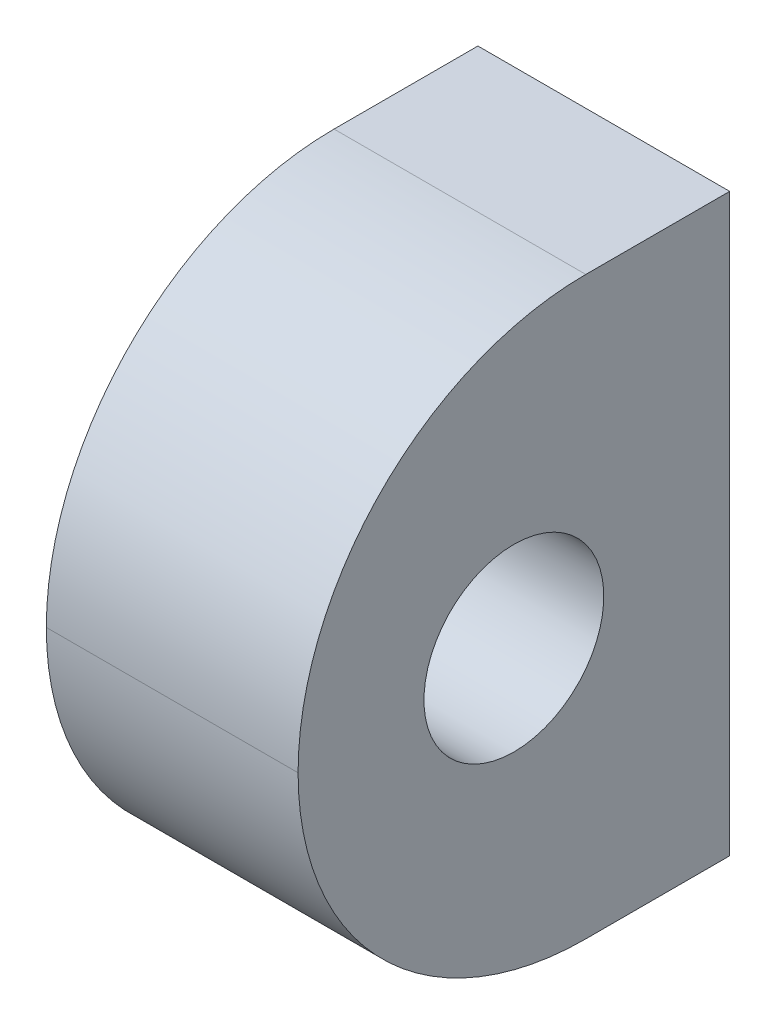
ISO-10303-21;
HEADER;
FILE_DESCRIPTION(('STEP AP214'),'2;1');
FILE_NAME('part.step','',(''),(''),'','','');
FILE_SCHEMA(('AUTOMOTIVE_DESIGN { 1 0 10303 214 1 1 1 1 }'));
ENDSEC;
DATA;
#1=APPLICATION_CONTEXT('core data for automotive mechanical design processes');
#2=APPLICATION_PROTOCOL_DEFINITION('international standard','automotive_design',2000,#1);
#3=PRODUCT_CONTEXT('',#1,'mechanical');
#4=PRODUCT('Part','Part','',(#3));
#5=PRODUCT_RELATED_PRODUCT_CATEGORY('part','',(#4));
#6=PRODUCT_DEFINITION_FORMATION('','',#4);
#7=PRODUCT_DEFINITION_CONTEXT('part definition',#1,'design');
#8=PRODUCT_DEFINITION('design','',#6,#7);
#9=PRODUCT_DEFINITION_SHAPE('','',#8);
#10=(LENGTH_UNIT() NAMED_UNIT(*) SI_UNIT(.MILLI.,.METRE.));
#11=(NAMED_UNIT(*) PLANE_ANGLE_UNIT() SI_UNIT($,.RADIAN.));
#12=(NAMED_UNIT(*) SI_UNIT($,.STERADIAN.) SOLID_ANGLE_UNIT());
#13=UNCERTAINTY_MEASURE_WITH_UNIT(LENGTH_MEASURE(1.E-05),#10,'distance_accuracy_value','');
#14=(GEOMETRIC_REPRESENTATION_CONTEXT(3) GLOBAL_UNCERTAINTY_ASSIGNED_CONTEXT((#13)) GLOBAL_UNIT_ASSIGNED_CONTEXT((#10,
#11,#12)) REPRESENTATION_CONTEXT('',''));
#15=CARTESIAN_POINT('',(0.,0.,0.));
#16=DIRECTION('',(0.,0.,1.));
#17=DIRECTION('',(1.,0.,0.));
#18=AXIS2_PLACEMENT_3D('',#15,#16,#17);
#19=CARTESIAN_POINT('',(0.,0.,38.1));
#20=DIRECTION('',(1.,0.,0.));
#21=DIRECTION('',(0.,1.,0.));
#22=AXIS2_PLACEMENT_3D('',#19,#20,#21);
#23=PLANE('',#22);
#24=CARTESIAN_POINT('',(0.,25.4,19.05));
#25=DIRECTION('',(1.,0.,0.));
#26=DIRECTION('',(0.,1.,0.));
#27=AXIS2_PLACEMENT_3D('',#24,#25,#26);
#28=CIRCLE('',#27,7.9375);
#29=CARTESIAN_POINT('',(0.,33.3375,19.05));
#30=VERTEX_POINT('',#29);
#31=EDGE_CURVE('E112',#30,#30,#28,.T.);
#32=ORIENTED_EDGE('',*,*,#31,.T.);
#33=EDGE_LOOP('',(#32));
#34=FACE_BOUND('',#33,.T.);
#35=DIRECTION('',(0.,0.,-1.));
#36=VECTOR('',#35,1.);
#37=CARTESIAN_POINT('',(0.,0.,38.1));
#38=LINE('',#37,#36);
#39=CARTESIAN_POINT('',(0.,0.,12.7));
#40=VERTEX_POINT('',#39);
#41=CARTESIAN_POINT('',(0.,0.,0.));
#42=VERTEX_POINT('',#41);
#43=EDGE_CURVE('E84',#40,#42,#38,.T.);
#44=ORIENTED_EDGE('',*,*,#43,.F.);
#45=CARTESIAN_POINT('',(0.,25.4,12.7));
#46=DIRECTION('',(1.,0.,0.));
#47=DIRECTION('',(0.,1.,0.));
#48=AXIS2_PLACEMENT_3D('',#45,#46,#47);
#49=CIRCLE('',#48,25.4);
#50=CARTESIAN_POINT('',(0.,25.4,38.1));
#51=VERTEX_POINT('',#50);
#52=EDGE_CURVE('E49',#40,#51,#49,.F.);
#53=ORIENTED_EDGE('',*,*,#52,.T.);
#54=CARTESIAN_POINT('',(0.,25.4,12.7));
#55=DIRECTION('',(1.,0.,0.));
#56=DIRECTION('',(0.,1.,0.));
#57=AXIS2_PLACEMENT_3D('',#54,#55,#56);
#58=CIRCLE('',#57,25.4);
#59=CARTESIAN_POINT('',(0.,50.8,12.7));
#60=VERTEX_POINT('',#59);
#61=EDGE_CURVE('E56',#51,#60,#58,.F.);
#62=ORIENTED_EDGE('',*,*,#61,.T.);
#63=DIRECTION('',(0.,0.,-1.));
#64=VECTOR('',#63,1.);
#65=CARTESIAN_POINT('',(0.,50.8,38.1));
#66=LINE('',#65,#64);
#67=CARTESIAN_POINT('',(0.,50.8,0.));
#68=VERTEX_POINT('',#67);
#69=EDGE_CURVE('E106',#60,#68,#66,.T.);
#70=ORIENTED_EDGE('',*,*,#69,.T.);
#71=DIRECTION('',(0.,-1.,0.));
#72=VECTOR('',#71,1.);
#73=CARTESIAN_POINT('',(0.,0.,0.));
#74=LINE('',#73,#72);
#75=EDGE_CURVE('E101',#68,#42,#74,.T.);
#76=ORIENTED_EDGE('',*,*,#75,.T.);
#77=EDGE_LOOP('',(#44,#53,#62,#70,#76));
#78=FACE_BOUND('',#77,.T.);
#79=ADVANCED_FACE('F39',(#34,#78),#23,.F.);
#80=CARTESIAN_POINT('',(0.,0.,38.1));
#81=DIRECTION('',(0.,1.,0.));
#82=DIRECTION('',(0.,0.,1.));
#83=AXIS2_PLACEMENT_3D('',#80,#81,#82);
#84=PLANE('',#83);
#85=DIRECTION('',(0.,0.,-1.));
#86=VECTOR('',#85,1.);
#87=CARTESIAN_POINT('',(22.225,0.,38.1));
#88=LINE('',#87,#86);
#89=CARTESIAN_POINT('',(22.225,0.,12.7));
#90=VERTEX_POINT('',#89);
#91=CARTESIAN_POINT('',(22.225,0.,0.));
#92=VERTEX_POINT('',#91);
#93=EDGE_CURVE('E95',#90,#92,#88,.T.);
#94=ORIENTED_EDGE('',*,*,#93,.F.);
#95=DIRECTION('',(1.,0.,0.));
#96=VECTOR('',#95,1.);
#97=CARTESIAN_POINT('',(0.,0.,12.7));
#98=LINE('',#97,#96);
#99=EDGE_CURVE('E91',#90,#40,#98,.F.);
#100=ORIENTED_EDGE('',*,*,#99,.T.);
#101=ORIENTED_EDGE('',*,*,#43,.T.);
#102=DIRECTION('',(1.,0.,0.));
#103=VECTOR('',#102,1.);
#104=CARTESIAN_POINT('',(0.,0.,0.));
#105=LINE('',#104,#103);
#106=EDGE_CURVE('E88',#42,#92,#105,.T.);
#107=ORIENTED_EDGE('',*,*,#106,.T.);
#108=EDGE_LOOP('',(#94,#100,#101,#107));
#109=FACE_BOUND('',#108,.T.);
#110=ADVANCED_FACE('F87',(#109),#84,.F.);
#111=CARTESIAN_POINT('',(22.225,0.,38.1));
#112=DIRECTION('',(-1.,0.,0.));
#113=DIRECTION('',(0.,-1.,0.));
#114=AXIS2_PLACEMENT_3D('',#111,#112,#113);
#115=PLANE('',#114);
#116=CARTESIAN_POINT('',(22.225,25.4,19.05));
#117=DIRECTION('',(1.,0.,0.));
#118=DIRECTION('',(0.,1.,0.));
#119=AXIS2_PLACEMENT_3D('',#116,#117,#118);
#120=CIRCLE('',#119,7.9375);
#121=CARTESIAN_POINT('',(22.225,33.3375,19.05));
#122=VERTEX_POINT('',#121);
#123=EDGE_CURVE('E220',#122,#122,#120,.T.);
#124=ORIENTED_EDGE('',*,*,#123,.F.);
#125=EDGE_LOOP('',(#124));
#126=FACE_BOUND('',#125,.T.);
#127=CARTESIAN_POINT('',(22.225,25.4,12.7));
#128=DIRECTION('',(-1.,0.,0.));
#129=DIRECTION('',(0.,-1.,0.));
#130=AXIS2_PLACEMENT_3D('',#127,#128,#129);
#131=CIRCLE('',#130,25.4);
#132=CARTESIAN_POINT('',(22.225,50.8,12.7));
#133=VERTEX_POINT('',#132);
#134=CARTESIAN_POINT('',(22.225,25.4,38.1));
#135=VERTEX_POINT('',#134);
#136=EDGE_CURVE('E94',#133,#135,#131,.F.);
#137=ORIENTED_EDGE('',*,*,#136,.T.);
#138=CARTESIAN_POINT('',(22.225,25.4,12.7));
#139=DIRECTION('',(-1.,0.,0.));
#140=DIRECTION('',(0.,-1.,0.));
#141=AXIS2_PLACEMENT_3D('',#138,#139,#140);
#142=CIRCLE('',#141,25.4);
#143=EDGE_CURVE('E130',#135,#90,#142,.F.);
#144=ORIENTED_EDGE('',*,*,#143,.T.);
#145=ORIENTED_EDGE('',*,*,#93,.T.);
#146=DIRECTION('',(0.,1.,0.));
#147=VECTOR('',#146,1.);
#148=CARTESIAN_POINT('',(22.225,0.,0.));
#149=LINE('',#148,#147);
#150=CARTESIAN_POINT('',(22.225,50.8,0.));
#151=VERTEX_POINT('',#150);
#152=EDGE_CURVE('E103',#92,#151,#149,.T.);
#153=ORIENTED_EDGE('',*,*,#152,.T.);
#154=DIRECTION('',(0.,0.,-1.));
#155=VECTOR('',#154,1.);
#156=CARTESIAN_POINT('',(22.225,50.8,38.1));
#157=LINE('',#156,#155);
#158=EDGE_CURVE('E123',#133,#151,#157,.T.);
#159=ORIENTED_EDGE('',*,*,#158,.F.);
#160=EDGE_LOOP('',(#137,#144,#145,#153,#159));
#161=FACE_BOUND('',#160,.T.);
#162=ADVANCED_FACE('F140',(#126,#161),#115,.F.);
#163=CARTESIAN_POINT('',(0.,50.8,38.1));
#164=DIRECTION('',(0.,-1.,0.));
#165=DIRECTION('',(0.,0.,-1.));
#166=AXIS2_PLACEMENT_3D('',#163,#164,#165);
#167=PLANE('',#166);
#168=ORIENTED_EDGE('',*,*,#69,.F.);
#169=DIRECTION('',(-1.,0.,0.));
#170=VECTOR('',#169,1.);
#171=CARTESIAN_POINT('',(0.,50.8,12.7));
#172=LINE('',#171,#170);
#173=EDGE_CURVE('E11',#60,#133,#172,.F.);
#174=ORIENTED_EDGE('',*,*,#173,.T.);
#175=ORIENTED_EDGE('',*,*,#158,.T.);
#176=DIRECTION('',(-1.,0.,0.));
#177=VECTOR('',#176,1.);
#178=CARTESIAN_POINT('',(0.,50.8,0.));
#179=LINE('',#178,#177);
#180=EDGE_CURVE('E118',#151,#68,#179,.T.);
#181=ORIENTED_EDGE('',*,*,#180,.T.);
#182=EDGE_LOOP('',(#168,#174,#175,#181));
#183=FACE_BOUND('',#182,.T.);
#184=ADVANCED_FACE('F149',(#183),#167,.F.);
#185=CARTESIAN_POINT('',(0.,0.,0.));
#186=DIRECTION('',(0.,0.,-1.));
#187=DIRECTION('',(-1.,0.,0.));
#188=AXIS2_PLACEMENT_3D('',#185,#186,#187);
#189=PLANE('',#188);
#190=ORIENTED_EDGE('',*,*,#75,.F.);
#191=ORIENTED_EDGE('',*,*,#180,.F.);
#192=ORIENTED_EDGE('',*,*,#152,.F.);
#193=ORIENTED_EDGE('',*,*,#106,.F.);
#194=EDGE_LOOP('',(#190,#191,#192,#193));
#195=FACE_BOUND('',#194,.T.);
#196=ADVANCED_FACE('F99',(#195),#189,.T.);
#197=CARTESIAN_POINT('',(0.,25.4,12.7));
#198=DIRECTION('',(-1.,0.,0.));
#199=DIRECTION('',(0.,0.,1.));
#200=AXIS2_PLACEMENT_3D('',#197,#198,#199);
#201=CYLINDRICAL_SURFACE('',#200,25.4);
#202=ORIENTED_EDGE('',*,*,#173,.F.);
#203=ORIENTED_EDGE('',*,*,#61,.F.);
#204=DIRECTION('',(-1.,0.,0.));
#205=VECTOR('',#204,1.);
#206=CARTESIAN_POINT('',(0.,25.4,38.1));
#207=LINE('',#206,#205);
#208=EDGE_CURVE('E43',#135,#51,#207,.T.);
#209=ORIENTED_EDGE('',*,*,#208,.F.);
#210=ORIENTED_EDGE('',*,*,#136,.F.);
#211=EDGE_LOOP('',(#202,#203,#209,#210));
#212=FACE_BOUND('',#211,.T.);
#213=ADVANCED_FACE('F41',(#212),#201,.T.);
#214=CARTESIAN_POINT('',(0.,25.4,12.7));
#215=DIRECTION('',(1.,0.,0.));
#216=DIRECTION('',(0.,0.,-1.));
#217=AXIS2_PLACEMENT_3D('',#214,#215,#216);
#218=CYLINDRICAL_SURFACE('',#217,25.4);
#219=ORIENTED_EDGE('',*,*,#52,.F.);
#220=ORIENTED_EDGE('',*,*,#99,.F.);
#221=ORIENTED_EDGE('',*,*,#143,.F.);
#222=ORIENTED_EDGE('',*,*,#208,.T.);
#223=EDGE_LOOP('',(#219,#220,#221,#222));
#224=FACE_BOUND('',#223,.T.);
#225=ADVANCED_FACE('F145',(#224),#218,.T.);
#226=CARTESIAN_POINT('',(-15.875,25.4,19.05));
#227=DIRECTION('',(1.,0.,0.));
#228=DIRECTION('',(0.,1.,0.));
#229=AXIS2_PLACEMENT_3D('',#226,#227,#228);
#230=CYLINDRICAL_SURFACE('',#229,7.9375);
#231=CARTESIAN_POINT('',(22.225,33.3375,19.05));
#232=CARTESIAN_POINT('',(21.9934895833333,33.3375,19.05));
#233=CARTESIAN_POINT('',(21.7619791666667,33.3375,19.05));
#234=CARTESIAN_POINT('',(21.2989583333333,33.3375,19.05));
#235=CARTESIAN_POINT('',(21.0674479166667,33.3375,19.05));
#236=CARTESIAN_POINT('',(20.6044270833333,33.3375,19.05));
#237=CARTESIAN_POINT('',(20.3729166666667,33.3375,19.05));
#238=CARTESIAN_POINT('',(19.9098958333333,33.3375,19.05));
#239=CARTESIAN_POINT('',(19.6783854166667,33.3375,19.05));
#240=CARTESIAN_POINT('',(19.2153645833333,33.3375,19.05));
#241=CARTESIAN_POINT('',(18.9838541666667,33.3375,19.05));
#242=CARTESIAN_POINT('',(18.5208333333333,33.3375,19.05));
#243=CARTESIAN_POINT('',(18.2893229166667,33.3375,19.05));
#244=CARTESIAN_POINT('',(17.8263020833333,33.3375,19.05));
#245=CARTESIAN_POINT('',(17.5947916666667,33.3375,19.05));
#246=CARTESIAN_POINT('',(17.1317708333333,33.3375,19.05));
#247=CARTESIAN_POINT('',(16.9002604166667,33.3375,19.05));
#248=CARTESIAN_POINT('',(16.4372395833333,33.3375,19.05));
#249=CARTESIAN_POINT('',(16.2057291666667,33.3375,19.05));
#250=CARTESIAN_POINT('',(15.7427083333333,33.3375,19.05));
#251=CARTESIAN_POINT('',(15.5111979166667,33.3375,19.05));
#252=CARTESIAN_POINT('',(15.0481770833333,33.3375,19.05));
#253=CARTESIAN_POINT('',(14.8166666666667,33.3375,19.05));
#254=CARTESIAN_POINT('',(14.3536458333333,33.3375,19.05));
#255=CARTESIAN_POINT('',(14.1221354166667,33.3375,19.05));
#256=CARTESIAN_POINT('',(13.6591145833333,33.3375,19.05));
#257=CARTESIAN_POINT('',(13.4276041666667,33.3375,19.05));
#258=CARTESIAN_POINT('',(12.9645833333333,33.3375,19.05));
#259=CARTESIAN_POINT('',(12.7330729166667,33.3375,19.05));
#260=CARTESIAN_POINT('',(12.2700520833333,33.3375,19.05));
#261=CARTESIAN_POINT('',(12.0385416666667,33.3375,19.05));
#262=CARTESIAN_POINT('',(11.5755208333333,33.3375,19.05));
#263=CARTESIAN_POINT('',(11.3440104166667,33.3375,19.05));
#264=CARTESIAN_POINT('',(10.8809895833333,33.3375,19.05));
#265=CARTESIAN_POINT('',(10.6494791666667,33.3375,19.05));
#266=CARTESIAN_POINT('',(10.1864583333333,33.3375,19.05));
#267=CARTESIAN_POINT('',(9.95494791666666,33.3375,19.05));
#268=CARTESIAN_POINT('',(9.49192708333333,33.3375,19.05));
#269=CARTESIAN_POINT('',(9.26041666666666,33.3375,19.05));
#270=CARTESIAN_POINT('',(8.79739583333333,33.3375,19.05));
#271=CARTESIAN_POINT('',(8.56588541666666,33.3375,19.05));
#272=CARTESIAN_POINT('',(8.10286458333333,33.3375,19.05));
#273=CARTESIAN_POINT('',(7.87135416666666,33.3375,19.05));
#274=CARTESIAN_POINT('',(7.40833333333333,33.3375,19.05));
#275=CARTESIAN_POINT('',(7.17682291666666,33.3375,19.05));
#276=CARTESIAN_POINT('',(6.71380208333333,33.3375,19.05));
#277=CARTESIAN_POINT('',(6.48229166666666,33.3375,19.05));
#278=CARTESIAN_POINT('',(6.01927083333333,33.3375,19.05));
#279=CARTESIAN_POINT('',(5.78776041666666,33.3375,19.05));
#280=CARTESIAN_POINT('',(5.32473958333333,33.3375,19.05));
#281=CARTESIAN_POINT('',(5.09322916666666,33.3375,19.05));
#282=CARTESIAN_POINT('',(4.63020833333333,33.3375,19.05));
#283=CARTESIAN_POINT('',(4.39869791666666,33.3375,19.05));
#284=CARTESIAN_POINT('',(3.93567708333333,33.3375,19.05));
#285=CARTESIAN_POINT('',(3.70416666666666,33.3375,19.05));
#286=CARTESIAN_POINT('',(3.24114583333333,33.3375,19.05));
#287=CARTESIAN_POINT('',(3.00963541666666,33.3375,19.05));
#288=CARTESIAN_POINT('',(2.54661458333333,33.3375,19.05));
#289=CARTESIAN_POINT('',(2.31510416666666,33.3375,19.05));
#290=CARTESIAN_POINT('',(1.85208333333333,33.3375,19.05));
#291=CARTESIAN_POINT('',(1.62057291666666,33.3375,19.05));
#292=CARTESIAN_POINT('',(1.15755208333333,33.3375,19.05));
#293=CARTESIAN_POINT('',(0.926041666666661,33.3375,19.05));
#294=CARTESIAN_POINT('',(0.463020833333327,33.3375,19.05));
#295=CARTESIAN_POINT('',(0.23151041666666,33.3375,19.05));
#296=CARTESIAN_POINT('',(0.,33.3375,19.05));
#297=B_SPLINE_CURVE_WITH_KNOTS('',3,(#231,#232,#233,#234,#235,#236,#237,#238,#239,#240,#241,
#242,#243,#244,#245,#246,#247,#248,#249,#250,#251,#252,#253,#254,#255,#256,#257,#258,#259,#260,
#261,#262,#263,#264,#265,#266,#267,#268,#269,#270,#271,#272,#273,#274,#275,#276,#277,#278,#279,
#280,#281,#282,#283,#284,#285,#286,#287,#288,#289,#290,#291,#292,#293,#294,#295,#296),
.UNSPECIFIED.,.F.,.F.,(4,2,2,2,2,2,2,2,2,2,2,2,2,2,2,2,2,2,2,2,2,2,2,2,2,2,2,2,2,2,2,2,4),(0.,
0.694531249999998,1.3890625,2.08359375,2.778125,3.47265625,4.1671875,4.86171875,5.55625,
6.25078125,6.9453125,7.63984375,8.334375,9.02890625,9.7234375,10.41796875,11.1125,11.80703125,
12.5015625,13.19609375,13.890625,14.58515625,15.2796875,15.97421875,16.66875,17.36328125,
18.0578125,18.75234375,19.446875,20.14140625,20.8359375,21.53046875,22.225),.UNSPECIFIED.);
#298=EDGE_CURVE('BSEAM168',#122,#30,#297,.T.);
#299=ORIENTED_EDGE('',*,*,#123,.T.);
#300=ORIENTED_EDGE('',*,*,#31,.F.);
#301=ORIENTED_EDGE('',*,*,#298,.T.);
#302=ORIENTED_EDGE('',*,*,#298,.F.);
#303=EDGE_LOOP('',(#299,#301,#300,#302));
#304=FACE_BOUND('',#303,.T.);
#305=ADVANCED_FACE('F168',(#304),#230,.F.);
#306=CLOSED_SHELL('',(#79,#110,#162,#184,#196,#213,#225,#305));
#307=MANIFOLD_SOLID_BREP('B2',#306);
#308=ADVANCED_BREP_SHAPE_REPRESENTATION('',(#18,#307),#14);
#309=SHAPE_DEFINITION_REPRESENTATION(#9,#308);
ENDSEC;
END-ISO-10303-21;
